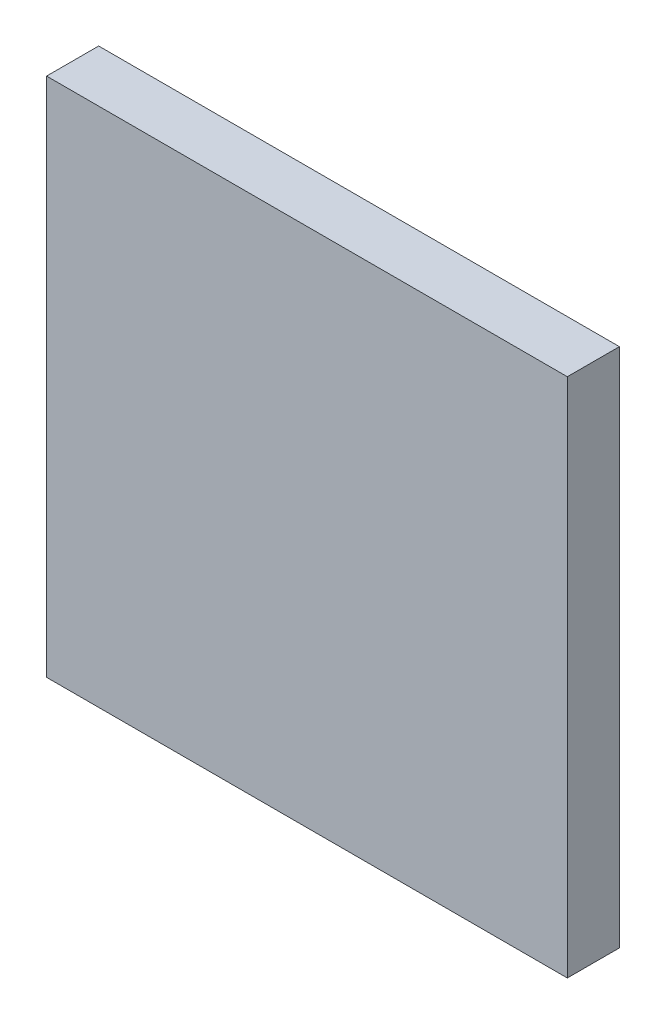
ISO-10303-21;
HEADER;
FILE_DESCRIPTION(('STEP AP214'),'2;1');
FILE_NAME('part.step','',(''),(''),'','','');
FILE_SCHEMA(('AUTOMOTIVE_DESIGN { 1 0 10303 214 1 1 1 1 }'));
ENDSEC;
DATA;
#1=APPLICATION_CONTEXT('core data for automotive mechanical design processes');
#2=APPLICATION_PROTOCOL_DEFINITION('international standard','automotive_design',2000,#1);
#3=PRODUCT_CONTEXT('',#1,'mechanical');
#4=PRODUCT('Part','Part','',(#3));
#5=PRODUCT_RELATED_PRODUCT_CATEGORY('part','',(#4));
#6=PRODUCT_DEFINITION_FORMATION('','',#4);
#7=PRODUCT_DEFINITION_CONTEXT('part definition',#1,'design');
#8=PRODUCT_DEFINITION('design','',#6,#7);
#9=PRODUCT_DEFINITION_SHAPE('','',#8);
#10=(LENGTH_UNIT() NAMED_UNIT(*) SI_UNIT(.MILLI.,.METRE.));
#11=(NAMED_UNIT(*) PLANE_ANGLE_UNIT() SI_UNIT($,.RADIAN.));
#12=(NAMED_UNIT(*) SI_UNIT($,.STERADIAN.) SOLID_ANGLE_UNIT());
#13=UNCERTAINTY_MEASURE_WITH_UNIT(LENGTH_MEASURE(1.E-05),#10,'distance_accuracy_value','');
#14=(GEOMETRIC_REPRESENTATION_CONTEXT(3) GLOBAL_UNCERTAINTY_ASSIGNED_CONTEXT((#13)) GLOBAL_UNIT_ASSIGNED_CONTEXT((#10,
#11,#12)) REPRESENTATION_CONTEXT('',''));
#15=CARTESIAN_POINT('',(0.,0.,0.));
#16=DIRECTION('',(0.,0.,1.));
#17=DIRECTION('',(1.,0.,0.));
#18=AXIS2_PLACEMENT_3D('',#15,#16,#17);
#19=CARTESIAN_POINT('',(0.,0.,50.8));
#20=DIRECTION('',(-1.,0.,0.));
#21=DIRECTION('',(0.,0.,1.));
#22=AXIS2_PLACEMENT_3D('',#19,#20,#21);
#23=PLANE('',#22);
#24=DIRECTION('',(0.,1.,0.));
#25=VECTOR('',#24,1.);
#26=CARTESIAN_POINT('',(0.,0.,0.));
#27=LINE('',#26,#25);
#28=CARTESIAN_POINT('',(0.,0.,0.));
#29=VERTEX_POINT('',#28);
#30=CARTESIAN_POINT('',(0.,508.,0.));
#31=VERTEX_POINT('',#30);
#32=EDGE_CURVE('E107',#29,#31,#27,.T.);
#33=ORIENTED_EDGE('',*,*,#32,.T.);
#34=DIRECTION('',(0.,0.,-1.));
#35=VECTOR('',#34,1.);
#36=CARTESIAN_POINT('',(0.,508.,50.8));
#37=LINE('',#36,#35);
#38=CARTESIAN_POINT('',(0.,508.,50.8));
#39=VERTEX_POINT('',#38);
#40=EDGE_CURVE('E11',#39,#31,#37,.T.);
#41=ORIENTED_EDGE('',*,*,#40,.F.);
#42=DIRECTION('',(0.,1.,0.));
#43=VECTOR('',#42,1.);
#44=CARTESIAN_POINT('',(0.,0.,50.8));
#45=LINE('',#44,#43);
#46=CARTESIAN_POINT('',(0.,0.,50.8));
#47=VERTEX_POINT('',#46);
#48=EDGE_CURVE('E91',#47,#39,#45,.T.);
#49=ORIENTED_EDGE('',*,*,#48,.F.);
#50=DIRECTION('',(0.,0.,-1.));
#51=VECTOR('',#50,1.);
#52=CARTESIAN_POINT('',(0.,0.,50.8));
#53=LINE('',#52,#51);
#54=EDGE_CURVE('E103',#47,#29,#53,.T.);
#55=ORIENTED_EDGE('',*,*,#54,.T.);
#56=EDGE_LOOP('',(#33,#41,#49,#55));
#57=FACE_BOUND('',#56,.T.);
#58=ADVANCED_FACE('F39',(#57),#23,.F.);
#59=CARTESIAN_POINT('',(0.,508.,50.8));
#60=DIRECTION('',(0.,-1.,0.));
#61=DIRECTION('',(0.,0.,-1.));
#62=AXIS2_PLACEMENT_3D('',#59,#60,#61);
#63=PLANE('',#62);
#64=DIRECTION('',(-1.,0.,0.));
#65=VECTOR('',#64,1.);
#66=CARTESIAN_POINT('',(0.,508.,0.));
#67=LINE('',#66,#65);
#68=CARTESIAN_POINT('',(-508.,508.,0.));
#69=VERTEX_POINT('',#68);
#70=EDGE_CURVE('E96',#31,#69,#67,.T.);
#71=ORIENTED_EDGE('',*,*,#70,.T.);
#72=DIRECTION('',(0.,0.,-1.));
#73=VECTOR('',#72,1.);
#74=CARTESIAN_POINT('',(-508.,508.,50.8));
#75=LINE('',#74,#73);
#76=CARTESIAN_POINT('',(-508.,508.,50.8));
#77=VERTEX_POINT('',#76);
#78=EDGE_CURVE('E48',#77,#69,#75,.T.);
#79=ORIENTED_EDGE('',*,*,#78,.F.);
#80=DIRECTION('',(-1.,0.,0.));
#81=VECTOR('',#80,1.);
#82=CARTESIAN_POINT('',(0.,508.,50.8));
#83=LINE('',#82,#81);
#84=EDGE_CURVE('E86',#39,#77,#83,.T.);
#85=ORIENTED_EDGE('',*,*,#84,.F.);
#86=ORIENTED_EDGE('',*,*,#40,.T.);
#87=EDGE_LOOP('',(#71,#79,#85,#86));
#88=FACE_BOUND('',#87,.T.);
#89=ADVANCED_FACE('F95',(#88),#63,.F.);
#90=CARTESIAN_POINT('',(-508.,0.,50.8));
#91=DIRECTION('',(1.,0.,0.));
#92=DIRECTION('',(0.,0.,-1.));
#93=AXIS2_PLACEMENT_3D('',#90,#91,#92);
#94=PLANE('',#93);
#95=DIRECTION('',(0.,-1.,0.));
#96=VECTOR('',#95,1.);
#97=CARTESIAN_POINT('',(-508.,0.,0.));
#98=LINE('',#97,#96);
#99=CARTESIAN_POINT('',(-508.,0.,0.));
#100=VERTEX_POINT('',#99);
#101=EDGE_CURVE('E73',#69,#100,#98,.T.);
#102=ORIENTED_EDGE('',*,*,#101,.T.);
#103=DIRECTION('',(0.,0.,-1.));
#104=VECTOR('',#103,1.);
#105=CARTESIAN_POINT('',(-508.,0.,50.8));
#106=LINE('',#105,#104);
#107=CARTESIAN_POINT('',(-508.,0.,50.8));
#108=VERTEX_POINT('',#107);
#109=EDGE_CURVE('E98',#108,#100,#106,.T.);
#110=ORIENTED_EDGE('',*,*,#109,.F.);
#111=DIRECTION('',(0.,-1.,0.));
#112=VECTOR('',#111,1.);
#113=CARTESIAN_POINT('',(-508.,0.,50.8));
#114=LINE('',#113,#112);
#115=EDGE_CURVE('E89',#77,#108,#114,.T.);
#116=ORIENTED_EDGE('',*,*,#115,.F.);
#117=ORIENTED_EDGE('',*,*,#78,.T.);
#118=EDGE_LOOP('',(#102,#110,#116,#117));
#119=FACE_BOUND('',#118,.T.);
#120=ADVANCED_FACE('F99',(#119),#94,.F.);
#121=CARTESIAN_POINT('',(0.,0.,50.8));
#122=DIRECTION('',(0.,1.,0.));
#123=DIRECTION('',(-1.,0.,0.));
#124=AXIS2_PLACEMENT_3D('',#121,#122,#123);
#125=PLANE('',#124);
#126=DIRECTION('',(1.,0.,0.));
#127=VECTOR('',#126,1.);
#128=CARTESIAN_POINT('',(0.,0.,0.));
#129=LINE('',#128,#127);
#130=EDGE_CURVE('E79',#100,#29,#129,.T.);
#131=ORIENTED_EDGE('',*,*,#130,.T.);
#132=ORIENTED_EDGE('',*,*,#54,.F.);
#133=DIRECTION('',(1.,0.,0.));
#134=VECTOR('',#133,1.);
#135=CARTESIAN_POINT('',(0.,0.,50.8));
#136=LINE('',#135,#134);
#137=EDGE_CURVE('E56',#108,#47,#136,.T.);
#138=ORIENTED_EDGE('',*,*,#137,.F.);
#139=ORIENTED_EDGE('',*,*,#109,.T.);
#140=EDGE_LOOP('',(#131,#132,#138,#139));
#141=FACE_BOUND('',#140,.T.);
#142=ADVANCED_FACE('F120',(#141),#125,.F.);
#143=CARTESIAN_POINT('',(0.,0.,50.8));
#144=DIRECTION('',(0.,0.,1.));
#145=DIRECTION('',(1.,0.,0.));
#146=AXIS2_PLACEMENT_3D('',#143,#144,#145);
#147=PLANE('',#146);
#148=ORIENTED_EDGE('',*,*,#48,.T.);
#149=ORIENTED_EDGE('',*,*,#84,.T.);
#150=ORIENTED_EDGE('',*,*,#115,.T.);
#151=ORIENTED_EDGE('',*,*,#137,.T.);
#152=EDGE_LOOP('',(#148,#149,#150,#151));
#153=FACE_BOUND('',#152,.T.);
#154=ADVANCED_FACE('F87',(#153),#147,.T.);
#155=CARTESIAN_POINT('',(0.,0.,0.));
#156=DIRECTION('',(0.,0.,1.));
#157=DIRECTION('',(1.,0.,0.));
#158=AXIS2_PLACEMENT_3D('',#155,#156,#157);
#159=PLANE('',#158);
#160=ORIENTED_EDGE('',*,*,#32,.F.);
#161=ORIENTED_EDGE('',*,*,#130,.F.);
#162=ORIENTED_EDGE('',*,*,#101,.F.);
#163=ORIENTED_EDGE('',*,*,#70,.F.);
#164=EDGE_LOOP('',(#160,#161,#162,#163));
#165=FACE_BOUND('',#164,.T.);
#166=ADVANCED_FACE('F123',(#165),#159,.F.);
#167=CLOSED_SHELL('',(#58,#89,#120,#142,#154,#166));
#168=MANIFOLD_SOLID_BREP('B2',#167);
#169=ADVANCED_BREP_SHAPE_REPRESENTATION('',(#18,#168),#14);
#170=SHAPE_DEFINITION_REPRESENTATION(#9,#169);
ENDSEC;
END-ISO-10303-21;
